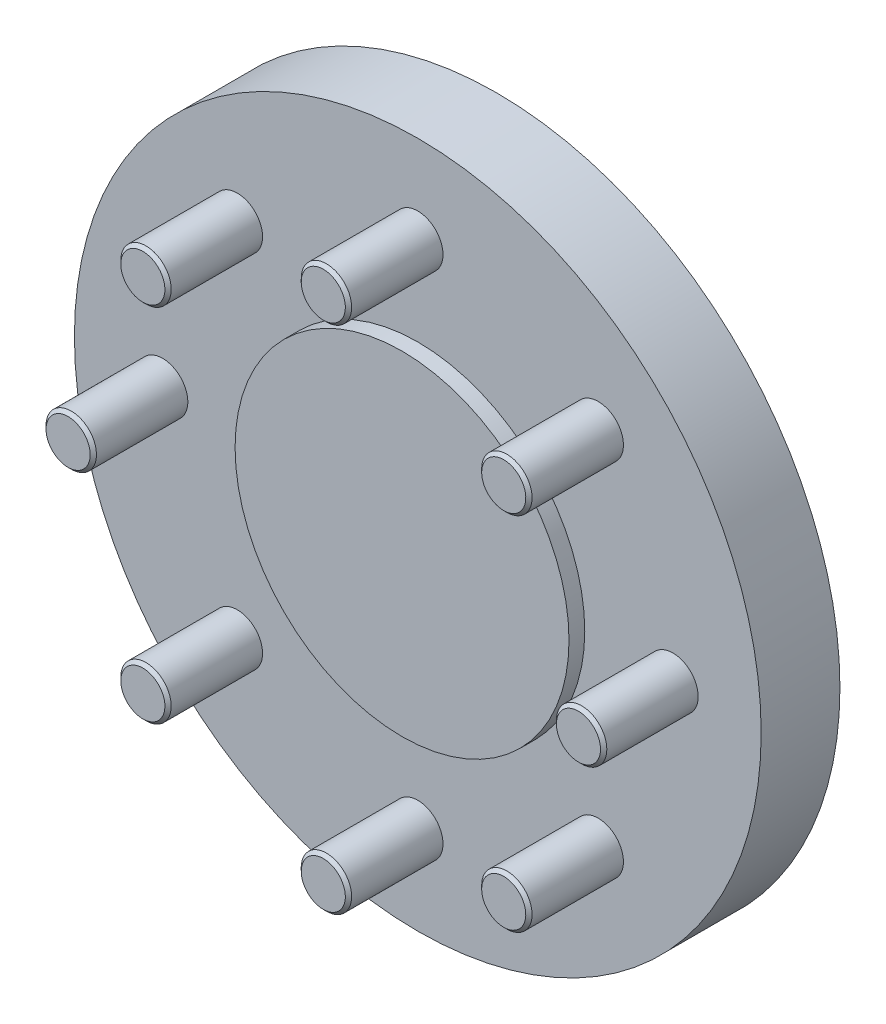
ISO-10303-21;
HEADER;
FILE_DESCRIPTION(('STEP AP214'),'2;1');
FILE_NAME('part.step','',(''),(''),'','','');
FILE_SCHEMA(('AUTOMOTIVE_DESIGN { 1 0 10303 214 1 1 1 1 }'));
ENDSEC;
DATA;
#1=APPLICATION_CONTEXT('core data for automotive mechanical design processes');
#2=APPLICATION_PROTOCOL_DEFINITION('international standard','automotive_design',2000,#1);
#3=PRODUCT_CONTEXT('',#1,'mechanical');
#4=PRODUCT('Part','Part','',(#3));
#5=PRODUCT_RELATED_PRODUCT_CATEGORY('part','',(#4));
#6=PRODUCT_DEFINITION_FORMATION('','',#4);
#7=PRODUCT_DEFINITION_CONTEXT('part definition',#1,'design');
#8=PRODUCT_DEFINITION('design','',#6,#7);
#9=PRODUCT_DEFINITION_SHAPE('','',#8);
#10=(LENGTH_UNIT() NAMED_UNIT(*) SI_UNIT(.MILLI.,.METRE.));
#11=(NAMED_UNIT(*) PLANE_ANGLE_UNIT() SI_UNIT($,.RADIAN.));
#12=(NAMED_UNIT(*) SI_UNIT($,.STERADIAN.) SOLID_ANGLE_UNIT());
#13=UNCERTAINTY_MEASURE_WITH_UNIT(LENGTH_MEASURE(1.E-05),#10,'distance_accuracy_value','');
#14=(GEOMETRIC_REPRESENTATION_CONTEXT(3) GLOBAL_UNCERTAINTY_ASSIGNED_CONTEXT((#13)) GLOBAL_UNIT_ASSIGNED_CONTEXT((#10,
#11,#12)) REPRESENTATION_CONTEXT('',''));
#15=CARTESIAN_POINT('',(0.,0.,0.));
#16=DIRECTION('',(0.,0.,1.));
#17=DIRECTION('',(1.,0.,0.));
#18=AXIS2_PLACEMENT_3D('',#15,#16,#17);
#19=CARTESIAN_POINT('',(53.,0.,0.));
#20=DIRECTION('',(0.,0.,1.));
#21=DIRECTION('',(1.,0.,0.));
#22=AXIS2_PLACEMENT_3D('',#19,#20,#21);
#23=PLANE('',#22);
#24=CARTESIAN_POINT('',(0.,0.,0.));
#25=DIRECTION('',(0.,0.,1.));
#26=DIRECTION('',(1.,0.,0.));
#27=AXIS2_PLACEMENT_3D('',#24,#25,#26);
#28=CIRCLE('',#27,53.);
#29=CARTESIAN_POINT('',(53.,0.,0.));
#30=VERTEX_POINT('',#29);
#31=EDGE_CURVE('E67',#30,#30,#28,.T.);
#32=ORIENTED_EDGE('',*,*,#31,.T.);
#33=EDGE_LOOP('',(#32));
#34=FACE_BOUND('',#33,.T.);
#35=ADVANCED_FACE('F37',(#34),#23,.T.);
#36=CARTESIAN_POINT('',(0.,0.,-75.));
#37=DIRECTION('',(0.,0.,-1.));
#38=DIRECTION('',(-1.,0.,0.));
#39=AXIS2_PLACEMENT_3D('',#36,#37,#38);
#40=PLANE('',#39);
#41=CARTESIAN_POINT('',(0.,0.,-75.));
#42=DIRECTION('',(0.,0.,1.));
#43=DIRECTION('',(1.,0.,0.));
#44=AXIS2_PLACEMENT_3D('',#41,#42,#43);
#45=CIRCLE('',#44,30.);
#46=CARTESIAN_POINT('',(30.,0.,-75.));
#47=VERTEX_POINT('',#46);
#48=EDGE_CURVE('E49',#47,#47,#45,.T.);
#49=ORIENTED_EDGE('',*,*,#48,.F.);
#50=EDGE_LOOP('',(#49));
#51=FACE_BOUND('',#50,.T.);
#52=ADVANCED_FACE('F170',(#51),#40,.T.);
#53=CARTESIAN_POINT('',(0.,0.,0.));
#54=DIRECTION('',(0.,0.,1.));
#55=DIRECTION('',(1.,0.,0.));
#56=AXIS2_PLACEMENT_3D('',#53,#54,#55);
#57=CYLINDRICAL_SURFACE('',#56,30.);
#58=ORIENTED_EDGE('',*,*,#48,.T.);
#59=EDGE_LOOP('',(#58));
#60=FACE_BOUND('',#59,.T.);
#61=CARTESIAN_POINT('',(0.,0.,-30.));
#62=DIRECTION('',(0.,0.,1.));
#63=DIRECTION('',(1.,0.,0.));
#64=AXIS2_PLACEMENT_3D('',#61,#62,#63);
#65=CIRCLE('',#64,30.);
#66=CARTESIAN_POINT('',(30.,0.,-30.));
#67=VERTEX_POINT('',#66);
#68=EDGE_CURVE('E53',#67,#67,#65,.T.);
#69=ORIENTED_EDGE('',*,*,#68,.F.);
#70=EDGE_LOOP('',(#69));
#71=FACE_BOUND('',#70,.T.);
#72=ADVANCED_FACE('F174',(#60,#71),#57,.T.);
#73=CARTESIAN_POINT('',(30.,0.,-30.));
#74=DIRECTION('',(0.,0.,-1.));
#75=DIRECTION('',(-1.,0.,0.));
#76=AXIS2_PLACEMENT_3D('',#73,#74,#75);
#77=PLANE('',#76);
#78=ORIENTED_EDGE('',*,*,#68,.T.);
#79=EDGE_LOOP('',(#78));
#80=FACE_BOUND('',#79,.T.);
#81=CARTESIAN_POINT('',(0.,0.,-30.));
#82=DIRECTION('',(0.,0.,1.));
#83=DIRECTION('',(1.,0.,0.));
#84=AXIS2_PLACEMENT_3D('',#81,#82,#83);
#85=CIRCLE('',#84,109.);
#86=CARTESIAN_POINT('',(109.,0.,-30.));
#87=VERTEX_POINT('',#86);
#88=EDGE_CURVE('E58',#87,#87,#85,.T.);
#89=ORIENTED_EDGE('',*,*,#88,.F.);
#90=EDGE_LOOP('',(#89));
#91=FACE_BOUND('',#90,.T.);
#92=ADVANCED_FACE('F180',(#80,#91),#77,.T.);
#93=CARTESIAN_POINT('',(0.,0.,0.));
#94=DIRECTION('',(0.,0.,1.));
#95=DIRECTION('',(1.,0.,0.));
#96=AXIS2_PLACEMENT_3D('',#93,#94,#95);
#97=CYLINDRICAL_SURFACE('',#96,109.);
#98=ORIENTED_EDGE('',*,*,#88,.T.);
#99=EDGE_LOOP('',(#98));
#100=FACE_BOUND('',#99,.T.);
#101=CARTESIAN_POINT('',(0.,0.,-4.99999999999999));
#102=DIRECTION('',(0.,0.,1.));
#103=DIRECTION('',(1.,0.,0.));
#104=AXIS2_PLACEMENT_3D('',#101,#102,#103);
#105=CIRCLE('',#104,109.);
#106=CARTESIAN_POINT('',(109.,0.,-4.99999999999999));
#107=VERTEX_POINT('',#106);
#108=EDGE_CURVE('E61',#107,#107,#105,.T.);
#109=ORIENTED_EDGE('',*,*,#108,.F.);
#110=EDGE_LOOP('',(#109));
#111=FACE_BOUND('',#110,.T.);
#112=ADVANCED_FACE('F143',(#100,#111),#97,.T.);
#113=CARTESIAN_POINT('',(109.,0.,-4.99999999999999));
#114=DIRECTION('',(0.,0.,1.));
#115=DIRECTION('',(1.,0.,0.));
#116=AXIS2_PLACEMENT_3D('',#113,#114,#115);
#117=PLANE('',#116);
#118=CARTESIAN_POINT('',(57.275649276111,57.2756492761097,-4.99999999999999));
#119=DIRECTION('',(0.,0.,1.));
#120=DIRECTION('',(0.707106781186556,0.707106781186539,0.));
#121=AXIS2_PLACEMENT_3D('',#118,#119,#120);
#122=CIRCLE('',#121,8.00000000000001);
#123=CARTESIAN_POINT('',(62.9325035256035,62.932503525602,-4.99999999999999));
#124=VERTEX_POINT('',#123);
#125=EDGE_CURVE('E133',#124,#124,#122,.T.);
#126=ORIENTED_EDGE('',*,*,#125,.F.);
#127=EDGE_LOOP('',(#126));
#128=FACE_BOUND('',#127,.T.);
#129=CARTESIAN_POINT('',(8.48429965338881E-13,81.,-4.99999999999999));
#130=DIRECTION('',(0.,0.,1.));
#131=DIRECTION('',(0.,1.,0.));
#132=AXIS2_PLACEMENT_3D('',#129,#130,#131);
#133=CIRCLE('',#132,8.00000000000001);
#134=CARTESIAN_POINT('',(9.32225517471117E-13,89.,-4.99999999999999));
#135=VERTEX_POINT('',#134);
#136=EDGE_CURVE('E124',#135,#135,#133,.T.);
#137=ORIENTED_EDGE('',*,*,#136,.F.);
#138=EDGE_LOOP('',(#137));
#139=FACE_BOUND('',#138,.T.);
#140=CARTESIAN_POINT('',(-57.2756492761098,57.2756492761108,-4.99999999999999));
#141=DIRECTION('',(0.,0.,1.));
#142=DIRECTION('',(-0.707106781186541,0.707106781186554,0.));
#143=AXIS2_PLACEMENT_3D('',#140,#141,#142);
#144=CIRCLE('',#143,8.00000000000001);
#145=CARTESIAN_POINT('',(-62.9325035256022,62.9325035256033,-4.99999999999999));
#146=VERTEX_POINT('',#145);
#147=EDGE_CURVE('E115',#146,#146,#144,.T.);
#148=ORIENTED_EDGE('',*,*,#147,.F.);
#149=EDGE_LOOP('',(#148));
#150=FACE_BOUND('',#149,.T.);
#151=CARTESIAN_POINT('',(-81.,0.,-4.99999999999999));
#152=DIRECTION('',(0.,0.,1.));
#153=DIRECTION('',(-1.,0.,0.));
#154=AXIS2_PLACEMENT_3D('',#151,#152,#153);
#155=CIRCLE('',#154,8.00000000000001);
#156=CARTESIAN_POINT('',(-89.,0.,-4.99999999999999));
#157=VERTEX_POINT('',#156);
#158=EDGE_CURVE('E106',#157,#157,#155,.T.);
#159=ORIENTED_EDGE('',*,*,#158,.F.);
#160=EDGE_LOOP('',(#159));
#161=FACE_BOUND('',#160,.T.);
#162=CARTESIAN_POINT('',(-57.2756492761107,-57.2756492761101,-4.99999999999999));
#163=DIRECTION('',(0.,0.,1.));
#164=DIRECTION('',(-0.707106781186551,-0.707106781186544,0.));
#165=AXIS2_PLACEMENT_3D('',#162,#163,#164);
#166=CIRCLE('',#165,8.00000000000001);
#167=CARTESIAN_POINT('',(-62.9325035256031,-62.9325035256024,-4.99999999999999));
#168=VERTEX_POINT('',#167);
#169=EDGE_CURVE('E97',#168,#168,#166,.T.);
#170=ORIENTED_EDGE('',*,*,#169,.F.);
#171=EDGE_LOOP('',(#170));
#172=FACE_BOUND('',#171,.T.);
#173=CARTESIAN_POINT('',(-2.82809988446294E-13,-81.,-4.99999999999999));
#174=DIRECTION('',(0.,0.,1.));
#175=DIRECTION('',(0.,-1.,0.));
#176=AXIS2_PLACEMENT_3D('',#173,#174,#175);
#177=CIRCLE('',#176,8.00000000000001);
#178=CARTESIAN_POINT('',(-3.10741839157039E-13,-89.,-4.99999999999999));
#179=VERTEX_POINT('',#178);
#180=EDGE_CURVE('E88',#179,#179,#177,.T.);
#181=ORIENTED_EDGE('',*,*,#180,.F.);
#182=EDGE_LOOP('',(#181));
#183=FACE_BOUND('',#182,.T.);
#184=CARTESIAN_POINT('',(57.2756492761103,-57.2756492761104,-4.99999999999999));
#185=DIRECTION('',(0.,0.,1.));
#186=DIRECTION('',(0.707106781186546,-0.707106781186549,0.));
#187=AXIS2_PLACEMENT_3D('',#184,#185,#186);
#188=CIRCLE('',#187,8.00000000000001);
#189=CARTESIAN_POINT('',(62.9325035256026,-62.9325035256029,-4.99999999999999));
#190=VERTEX_POINT('',#189);
#191=EDGE_CURVE('E79',#190,#190,#188,.T.);
#192=ORIENTED_EDGE('',*,*,#191,.F.);
#193=EDGE_LOOP('',(#192));
#194=FACE_BOUND('',#193,.T.);
#195=CARTESIAN_POINT('',(81.,0.,-4.99999999999999));
#196=DIRECTION('',(0.,0.,1.));
#197=DIRECTION('',(1.,0.,0.));
#198=AXIS2_PLACEMENT_3D('',#195,#196,#197);
#199=CIRCLE('',#198,8.00000000000001);
#200=CARTESIAN_POINT('',(89.,0.,-4.99999999999999));
#201=VERTEX_POINT('',#200);
#202=EDGE_CURVE('E70',#201,#201,#199,.T.);
#203=ORIENTED_EDGE('',*,*,#202,.F.);
#204=EDGE_LOOP('',(#203));
#205=FACE_BOUND('',#204,.T.);
#206=ORIENTED_EDGE('',*,*,#108,.T.);
#207=EDGE_LOOP('',(#206));
#208=FACE_BOUND('',#207,.T.);
#209=CARTESIAN_POINT('',(0.,0.,-4.99999999999999));
#210=DIRECTION('',(0.,0.,1.));
#211=DIRECTION('',(1.,0.,0.));
#212=AXIS2_PLACEMENT_3D('',#209,#210,#211);
#213=CIRCLE('',#212,53.);
#214=CARTESIAN_POINT('',(53.,0.,-4.99999999999999));
#215=VERTEX_POINT('',#214);
#216=EDGE_CURVE('E64',#215,#215,#213,.T.);
#217=ORIENTED_EDGE('',*,*,#216,.F.);
#218=EDGE_LOOP('',(#217));
#219=FACE_BOUND('',#218,.T.);
#220=ADVANCED_FACE('F139',(#128,#139,#150,#161,#172,#183,#194,#205,#208,#219),#117,.T.);
#221=CARTESIAN_POINT('',(0.,0.,0.));
#222=DIRECTION('',(0.,0.,1.));
#223=DIRECTION('',(1.,0.,0.));
#224=AXIS2_PLACEMENT_3D('',#221,#222,#223);
#225=CYLINDRICAL_SURFACE('',#224,53.);
#226=ORIENTED_EDGE('',*,*,#216,.T.);
#227=EDGE_LOOP('',(#226));
#228=FACE_BOUND('',#227,.T.);
#229=ORIENTED_EDGE('',*,*,#31,.F.);
#230=EDGE_LOOP('',(#229));
#231=FACE_BOUND('',#230,.T.);
#232=ADVANCED_FACE('F142',(#228,#231),#225,.T.);
#233=CARTESIAN_POINT('',(81.,0.,25.));
#234=DIRECTION('',(0.,0.,-1.));
#235=DIRECTION('',(-1.,0.,0.));
#236=AXIS2_PLACEMENT_3D('',#233,#234,#235);
#237=CYLINDRICAL_SURFACE('',#236,8.00000000000001);
#238=CARTESIAN_POINT('',(81.,0.,24.));
#239=DIRECTION('',(0.,0.,1.));
#240=DIRECTION('',(1.,0.,0.));
#241=AXIS2_PLACEMENT_3D('',#238,#239,#240);
#242=CIRCLE('',#241,8.00000000000001);
#243=CARTESIAN_POINT('',(89.,0.,24.));
#244=VERTEX_POINT('',#243);
#245=EDGE_CURVE('E10',#244,#244,#242,.F.);
#246=ORIENTED_EDGE('',*,*,#245,.T.);
#247=EDGE_LOOP('',(#246));
#248=FACE_BOUND('',#247,.T.);
#249=ORIENTED_EDGE('',*,*,#202,.T.);
#250=EDGE_LOOP('',(#249));
#251=FACE_BOUND('',#250,.T.);
#252=ADVANCED_FACE('F165',(#248,#251),#237,.T.);
#253=CARTESIAN_POINT('',(81.,0.,25.));
#254=DIRECTION('',(0.,0.,1.));
#255=DIRECTION('',(1.,0.,0.));
#256=AXIS2_PLACEMENT_3D('',#253,#254,#255);
#257=PLANE('',#256);
#258=CARTESIAN_POINT('',(81.,0.,25.));
#259=DIRECTION('',(0.,0.,1.));
#260=DIRECTION('',(1.,0.,0.));
#261=AXIS2_PLACEMENT_3D('',#258,#259,#260);
#262=CIRCLE('',#261,6.99999999999998);
#263=CARTESIAN_POINT('',(88.,0.,25.));
#264=VERTEX_POINT('',#263);
#265=EDGE_CURVE('E45',#264,#264,#262,.T.);
#266=ORIENTED_EDGE('',*,*,#265,.T.);
#267=EDGE_LOOP('',(#266));
#268=FACE_BOUND('',#267,.T.);
#269=ADVANCED_FACE('F190',(#268),#257,.T.);
#270=CARTESIAN_POINT('',(81.,0.,25.));
#271=DIRECTION('',(0.,0.,-1.));
#272=DIRECTION('',(-1.,0.,0.));
#273=AXIS2_PLACEMENT_3D('',#270,#271,#272);
#274=CONICAL_SURFACE('',#273,6.99999999999998,0.785398163397461);
#275=ORIENTED_EDGE('',*,*,#245,.F.);
#276=EDGE_LOOP('',(#275));
#277=FACE_BOUND('',#276,.T.);
#278=ORIENTED_EDGE('',*,*,#265,.F.);
#279=EDGE_LOOP('',(#278));
#280=FACE_BOUND('',#279,.T.);
#281=ADVANCED_FACE('F40',(#277,#280),#274,.T.);
#282=CARTESIAN_POINT('',(57.2756492761103,-57.2756492761104,25.));
#283=DIRECTION('',(0.,0.,-1.));
#284=DIRECTION('',(-0.707106781186546,0.707106781186549,0.));
#285=AXIS2_PLACEMENT_3D('',#282,#283,#284);
#286=CYLINDRICAL_SURFACE('',#285,8.00000000000001);
#287=CARTESIAN_POINT('',(57.2756492761103,-57.2756492761104,24.));
#288=DIRECTION('',(0.,0.,1.));
#289=DIRECTION('',(0.707106781186546,-0.707106781186549,0.));
#290=AXIS2_PLACEMENT_3D('',#287,#288,#289);
#291=CIRCLE('',#290,8.00000000000001);
#292=CARTESIAN_POINT('',(62.9325035256026,-62.9325035256029,24.));
#293=VERTEX_POINT('',#292);
#294=EDGE_CURVE('E76',#293,#293,#291,.F.);
#295=ORIENTED_EDGE('',*,*,#294,.T.);
#296=EDGE_LOOP('',(#295));
#297=FACE_BOUND('',#296,.T.);
#298=ORIENTED_EDGE('',*,*,#191,.T.);
#299=EDGE_LOOP('',(#298));
#300=FACE_BOUND('',#299,.T.);
#301=ADVANCED_FACE('F193',(#297,#300),#286,.T.);
#302=CARTESIAN_POINT('',(57.2756492761103,-57.2756492761104,25.));
#303=DIRECTION('',(0.,0.,1.));
#304=DIRECTION('',(0.707106781186546,-0.707106781186549,0.));
#305=AXIS2_PLACEMENT_3D('',#302,#303,#304);
#306=PLANE('',#305);
#307=CARTESIAN_POINT('',(57.2756492761103,-57.2756492761104,25.));
#308=DIRECTION('',(0.,0.,1.));
#309=DIRECTION('',(0.707106781186546,-0.707106781186549,0.));
#310=AXIS2_PLACEMENT_3D('',#307,#308,#309);
#311=CIRCLE('',#310,6.99999999999998);
#312=CARTESIAN_POINT('',(62.2253967444161,-62.2253967444163,25.));
#313=VERTEX_POINT('',#312);
#314=EDGE_CURVE('E73',#313,#313,#311,.T.);
#315=ORIENTED_EDGE('',*,*,#314,.T.);
#316=EDGE_LOOP('',(#315));
#317=FACE_BOUND('',#316,.T.);
#318=ADVANCED_FACE('F196',(#317),#306,.T.);
#319=CARTESIAN_POINT('',(57.2756492761103,-57.2756492761104,25.));
#320=DIRECTION('',(0.,0.,-1.));
#321=DIRECTION('',(-0.707106781186546,0.707106781186549,0.));
#322=AXIS2_PLACEMENT_3D('',#319,#320,#321);
#323=CONICAL_SURFACE('',#322,6.99999999999998,0.785398163397461);
#324=ORIENTED_EDGE('',*,*,#294,.F.);
#325=EDGE_LOOP('',(#324));
#326=FACE_BOUND('',#325,.T.);
#327=ORIENTED_EDGE('',*,*,#314,.F.);
#328=EDGE_LOOP('',(#327));
#329=FACE_BOUND('',#328,.T.);
#330=ADVANCED_FACE('F200',(#326,#329),#323,.T.);
#331=CARTESIAN_POINT('',(-2.82809988446294E-13,-81.,25.));
#332=DIRECTION('',(0.,0.,-1.));
#333=DIRECTION('',(0.,1.,0.));
#334=AXIS2_PLACEMENT_3D('',#331,#332,#333);
#335=CYLINDRICAL_SURFACE('',#334,8.00000000000001);
#336=CARTESIAN_POINT('',(-2.82809988446294E-13,-81.,24.));
#337=DIRECTION('',(0.,0.,1.));
#338=DIRECTION('',(0.,-1.,0.));
#339=AXIS2_PLACEMENT_3D('',#336,#337,#338);
#340=CIRCLE('',#339,8.00000000000001);
#341=CARTESIAN_POINT('',(-3.10741839157039E-13,-89.,24.));
#342=VERTEX_POINT('',#341);
#343=EDGE_CURVE('E85',#342,#342,#340,.F.);
#344=ORIENTED_EDGE('',*,*,#343,.T.);
#345=EDGE_LOOP('',(#344));
#346=FACE_BOUND('',#345,.T.);
#347=ORIENTED_EDGE('',*,*,#180,.T.);
#348=EDGE_LOOP('',(#347));
#349=FACE_BOUND('',#348,.T.);
#350=ADVANCED_FACE('F208',(#346,#349),#335,.T.);
#351=CARTESIAN_POINT('',(-2.82809988446294E-13,-81.,25.));
#352=DIRECTION('',(0.,0.,1.));
#353=DIRECTION('',(0.,-1.,0.));
#354=AXIS2_PLACEMENT_3D('',#351,#352,#353);
#355=PLANE('',#354);
#356=CARTESIAN_POINT('',(-2.82809988446294E-13,-81.,25.));
#357=DIRECTION('',(0.,0.,1.));
#358=DIRECTION('',(0.,-1.,0.));
#359=AXIS2_PLACEMENT_3D('',#356,#357,#358);
#360=CIRCLE('',#359,6.99999999999998);
#361=CARTESIAN_POINT('',(-3.07250357818196E-13,-88.,25.));
#362=VERTEX_POINT('',#361);
#363=EDGE_CURVE('E82',#362,#362,#360,.T.);
#364=ORIENTED_EDGE('',*,*,#363,.T.);
#365=EDGE_LOOP('',(#364));
#366=FACE_BOUND('',#365,.T.);
#367=ADVANCED_FACE('F212',(#366),#355,.T.);
#368=CARTESIAN_POINT('',(-2.82809988446294E-13,-81.,25.));
#369=DIRECTION('',(0.,0.,-1.));
#370=DIRECTION('',(0.,1.,0.));
#371=AXIS2_PLACEMENT_3D('',#368,#369,#370);
#372=CONICAL_SURFACE('',#371,6.99999999999998,0.785398163397461);
#373=ORIENTED_EDGE('',*,*,#343,.F.);
#374=EDGE_LOOP('',(#373));
#375=FACE_BOUND('',#374,.T.);
#376=ORIENTED_EDGE('',*,*,#363,.F.);
#377=EDGE_LOOP('',(#376));
#378=FACE_BOUND('',#377,.T.);
#379=ADVANCED_FACE('F216',(#375,#378),#372,.T.);
#380=CARTESIAN_POINT('',(-57.2756492761107,-57.2756492761101,25.));
#381=DIRECTION('',(0.,0.,-1.));
#382=DIRECTION('',(0.707106781186551,0.707106781186544,0.));
#383=AXIS2_PLACEMENT_3D('',#380,#381,#382);
#384=CYLINDRICAL_SURFACE('',#383,8.00000000000001);
#385=CARTESIAN_POINT('',(-57.2756492761107,-57.2756492761101,24.));
#386=DIRECTION('',(0.,0.,1.));
#387=DIRECTION('',(-0.707106781186551,-0.707106781186544,0.));
#388=AXIS2_PLACEMENT_3D('',#385,#386,#387);
#389=CIRCLE('',#388,8.00000000000001);
#390=CARTESIAN_POINT('',(-62.9325035256031,-62.9325035256024,24.));
#391=VERTEX_POINT('',#390);
#392=EDGE_CURVE('E94',#391,#391,#389,.F.);
#393=ORIENTED_EDGE('',*,*,#392,.T.);
#394=EDGE_LOOP('',(#393));
#395=FACE_BOUND('',#394,.T.);
#396=ORIENTED_EDGE('',*,*,#169,.T.);
#397=EDGE_LOOP('',(#396));
#398=FACE_BOUND('',#397,.T.);
#399=ADVANCED_FACE('F223',(#395,#398),#384,.T.);
#400=CARTESIAN_POINT('',(-57.2756492761107,-57.2756492761101,25.));
#401=DIRECTION('',(0.,0.,1.));
#402=DIRECTION('',(-0.707106781186551,-0.707106781186544,0.));
#403=AXIS2_PLACEMENT_3D('',#400,#401,#402);
#404=PLANE('',#403);
#405=CARTESIAN_POINT('',(-57.2756492761107,-57.2756492761101,25.));
#406=DIRECTION('',(0.,0.,1.));
#407=DIRECTION('',(-0.707106781186551,-0.707106781186544,0.));
#408=AXIS2_PLACEMENT_3D('',#405,#406,#407);
#409=CIRCLE('',#408,6.99999999999998);
#410=CARTESIAN_POINT('',(-62.2253967444165,-62.2253967444158,25.));
#411=VERTEX_POINT('',#410);
#412=EDGE_CURVE('E91',#411,#411,#409,.T.);
#413=ORIENTED_EDGE('',*,*,#412,.T.);
#414=EDGE_LOOP('',(#413));
#415=FACE_BOUND('',#414,.T.);
#416=ADVANCED_FACE('F227',(#415),#404,.T.);
#417=CARTESIAN_POINT('',(-57.2756492761107,-57.2756492761101,25.));
#418=DIRECTION('',(0.,0.,-1.));
#419=DIRECTION('',(0.707106781186551,0.707106781186544,0.));
#420=AXIS2_PLACEMENT_3D('',#417,#418,#419);
#421=CONICAL_SURFACE('',#420,6.99999999999998,0.785398163397461);
#422=ORIENTED_EDGE('',*,*,#392,.F.);
#423=EDGE_LOOP('',(#422));
#424=FACE_BOUND('',#423,.T.);
#425=ORIENTED_EDGE('',*,*,#412,.F.);
#426=EDGE_LOOP('',(#425));
#427=FACE_BOUND('',#426,.T.);
#428=ADVANCED_FACE('F231',(#424,#427),#421,.T.);
#429=CARTESIAN_POINT('',(-81.,0.,25.));
#430=DIRECTION('',(0.,0.,-1.));
#431=DIRECTION('',(1.,0.,0.));
#432=AXIS2_PLACEMENT_3D('',#429,#430,#431);
#433=CYLINDRICAL_SURFACE('',#432,8.00000000000001);
#434=CARTESIAN_POINT('',(-81.,0.,24.));
#435=DIRECTION('',(0.,0.,1.));
#436=DIRECTION('',(-1.,0.,0.));
#437=AXIS2_PLACEMENT_3D('',#434,#435,#436);
#438=CIRCLE('',#437,8.00000000000001);
#439=CARTESIAN_POINT('',(-89.,0.,24.));
#440=VERTEX_POINT('',#439);
#441=EDGE_CURVE('E103',#440,#440,#438,.F.);
#442=ORIENTED_EDGE('',*,*,#441,.T.);
#443=EDGE_LOOP('',(#442));
#444=FACE_BOUND('',#443,.T.);
#445=ORIENTED_EDGE('',*,*,#158,.T.);
#446=EDGE_LOOP('',(#445));
#447=FACE_BOUND('',#446,.T.);
#448=ADVANCED_FACE('F238',(#444,#447),#433,.T.);
#449=CARTESIAN_POINT('',(-81.,0.,25.));
#450=DIRECTION('',(0.,0.,1.));
#451=DIRECTION('',(-1.,0.,0.));
#452=AXIS2_PLACEMENT_3D('',#449,#450,#451);
#453=PLANE('',#452);
#454=CARTESIAN_POINT('',(-81.,0.,25.));
#455=DIRECTION('',(0.,0.,1.));
#456=DIRECTION('',(-1.,0.,0.));
#457=AXIS2_PLACEMENT_3D('',#454,#455,#456);
#458=CIRCLE('',#457,6.99999999999998);
#459=CARTESIAN_POINT('',(-88.,0.,25.));
#460=VERTEX_POINT('',#459);
#461=EDGE_CURVE('E100',#460,#460,#458,.T.);
#462=ORIENTED_EDGE('',*,*,#461,.T.);
#463=EDGE_LOOP('',(#462));
#464=FACE_BOUND('',#463,.T.);
#465=ADVANCED_FACE('F242',(#464),#453,.T.);
#466=CARTESIAN_POINT('',(-81.,0.,25.));
#467=DIRECTION('',(0.,0.,-1.));
#468=DIRECTION('',(1.,0.,0.));
#469=AXIS2_PLACEMENT_3D('',#466,#467,#468);
#470=CONICAL_SURFACE('',#469,6.99999999999998,0.785398163397461);
#471=ORIENTED_EDGE('',*,*,#441,.F.);
#472=EDGE_LOOP('',(#471));
#473=FACE_BOUND('',#472,.T.);
#474=ORIENTED_EDGE('',*,*,#461,.F.);
#475=EDGE_LOOP('',(#474));
#476=FACE_BOUND('',#475,.T.);
#477=ADVANCED_FACE('F246',(#473,#476),#470,.T.);
#478=CARTESIAN_POINT('',(-57.2756492761098,57.2756492761108,25.));
#479=DIRECTION('',(0.,0.,-1.));
#480=DIRECTION('',(0.707106781186541,-0.707106781186554,0.));
#481=AXIS2_PLACEMENT_3D('',#478,#479,#480);
#482=CYLINDRICAL_SURFACE('',#481,8.00000000000001);
#483=CARTESIAN_POINT('',(-57.2756492761098,57.2756492761108,24.));
#484=DIRECTION('',(0.,0.,1.));
#485=DIRECTION('',(-0.707106781186541,0.707106781186554,0.));
#486=AXIS2_PLACEMENT_3D('',#483,#484,#485);
#487=CIRCLE('',#486,8.00000000000001);
#488=CARTESIAN_POINT('',(-62.9325035256022,62.9325035256033,24.));
#489=VERTEX_POINT('',#488);
#490=EDGE_CURVE('E112',#489,#489,#487,.F.);
#491=ORIENTED_EDGE('',*,*,#490,.T.);
#492=EDGE_LOOP('',(#491));
#493=FACE_BOUND('',#492,.T.);
#494=ORIENTED_EDGE('',*,*,#147,.T.);
#495=EDGE_LOOP('',(#494));
#496=FACE_BOUND('',#495,.T.);
#497=ADVANCED_FACE('F253',(#493,#496),#482,.T.);
#498=CARTESIAN_POINT('',(-57.2756492761098,57.2756492761108,25.));
#499=DIRECTION('',(0.,0.,1.));
#500=DIRECTION('',(-0.707106781186541,0.707106781186554,0.));
#501=AXIS2_PLACEMENT_3D('',#498,#499,#500);
#502=PLANE('',#501);
#503=CARTESIAN_POINT('',(-57.2756492761098,57.2756492761108,25.));
#504=DIRECTION('',(0.,0.,1.));
#505=DIRECTION('',(-0.707106781186541,0.707106781186554,0.));
#506=AXIS2_PLACEMENT_3D('',#503,#504,#505);
#507=CIRCLE('',#506,6.99999999999998);
#508=CARTESIAN_POINT('',(-62.2253967444156,62.2253967444167,25.));
#509=VERTEX_POINT('',#508);
#510=EDGE_CURVE('E109',#509,#509,#507,.T.);
#511=ORIENTED_EDGE('',*,*,#510,.T.);
#512=EDGE_LOOP('',(#511));
#513=FACE_BOUND('',#512,.T.);
#514=ADVANCED_FACE('F257',(#513),#502,.T.);
#515=CARTESIAN_POINT('',(-57.2756492761098,57.2756492761108,25.));
#516=DIRECTION('',(0.,0.,-1.));
#517=DIRECTION('',(0.707106781186541,-0.707106781186554,0.));
#518=AXIS2_PLACEMENT_3D('',#515,#516,#517);
#519=CONICAL_SURFACE('',#518,6.99999999999998,0.785398163397461);
#520=ORIENTED_EDGE('',*,*,#490,.F.);
#521=EDGE_LOOP('',(#520));
#522=FACE_BOUND('',#521,.T.);
#523=ORIENTED_EDGE('',*,*,#510,.F.);
#524=EDGE_LOOP('',(#523));
#525=FACE_BOUND('',#524,.T.);
#526=ADVANCED_FACE('F261',(#522,#525),#519,.T.);
#527=CARTESIAN_POINT('',(8.48429965338881E-13,81.,25.));
#528=DIRECTION('',(0.,0.,-1.));
#529=DIRECTION('',(0.,-1.,0.));
#530=AXIS2_PLACEMENT_3D('',#527,#528,#529);
#531=CYLINDRICAL_SURFACE('',#530,8.00000000000001);
#532=CARTESIAN_POINT('',(8.48429965338881E-13,81.,24.));
#533=DIRECTION('',(0.,0.,1.));
#534=DIRECTION('',(0.,1.,0.));
#535=AXIS2_PLACEMENT_3D('',#532,#533,#534);
#536=CIRCLE('',#535,8.00000000000001);
#537=CARTESIAN_POINT('',(9.32225517471117E-13,89.,24.));
#538=VERTEX_POINT('',#537);
#539=EDGE_CURVE('E121',#538,#538,#536,.F.);
#540=ORIENTED_EDGE('',*,*,#539,.T.);
#541=EDGE_LOOP('',(#540));
#542=FACE_BOUND('',#541,.T.);
#543=ORIENTED_EDGE('',*,*,#136,.T.);
#544=EDGE_LOOP('',(#543));
#545=FACE_BOUND('',#544,.T.);
#546=ADVANCED_FACE('F268',(#542,#545),#531,.T.);
#547=CARTESIAN_POINT('',(8.48429965338881E-13,81.,25.));
#548=DIRECTION('',(0.,0.,1.));
#549=DIRECTION('',(0.,1.,0.));
#550=AXIS2_PLACEMENT_3D('',#547,#548,#549);
#551=PLANE('',#550);
#552=CARTESIAN_POINT('',(8.48429965338881E-13,81.,25.));
#553=DIRECTION('',(0.,0.,1.));
#554=DIRECTION('',(0.,1.,0.));
#555=AXIS2_PLACEMENT_3D('',#552,#553,#554);
#556=CIRCLE('',#555,6.99999999999998);
#557=CARTESIAN_POINT('',(9.21751073454587E-13,88.,25.));
#558=VERTEX_POINT('',#557);
#559=EDGE_CURVE('E118',#558,#558,#556,.T.);
#560=ORIENTED_EDGE('',*,*,#559,.T.);
#561=EDGE_LOOP('',(#560));
#562=FACE_BOUND('',#561,.T.);
#563=ADVANCED_FACE('F272',(#562),#551,.T.);
#564=CARTESIAN_POINT('',(8.48429965338881E-13,81.,25.));
#565=DIRECTION('',(0.,0.,-1.));
#566=DIRECTION('',(0.,-1.,0.));
#567=AXIS2_PLACEMENT_3D('',#564,#565,#566);
#568=CONICAL_SURFACE('',#567,6.99999999999998,0.785398163397461);
#569=ORIENTED_EDGE('',*,*,#539,.F.);
#570=EDGE_LOOP('',(#569));
#571=FACE_BOUND('',#570,.T.);
#572=ORIENTED_EDGE('',*,*,#559,.F.);
#573=EDGE_LOOP('',(#572));
#574=FACE_BOUND('',#573,.T.);
#575=ADVANCED_FACE('F276',(#571,#574),#568,.T.);
#576=CARTESIAN_POINT('',(57.275649276111,57.2756492761097,25.));
#577=DIRECTION('',(0.,0.,-1.));
#578=DIRECTION('',(-0.707106781186556,-0.707106781186539,0.));
#579=AXIS2_PLACEMENT_3D('',#576,#577,#578);
#580=CYLINDRICAL_SURFACE('',#579,8.00000000000001);
#581=CARTESIAN_POINT('',(57.275649276111,57.2756492761097,24.));
#582=DIRECTION('',(0.,0.,1.));
#583=DIRECTION('',(0.707106781186556,0.707106781186539,0.));
#584=AXIS2_PLACEMENT_3D('',#581,#582,#583);
#585=CIRCLE('',#584,8.00000000000001);
#586=CARTESIAN_POINT('',(62.9325035256035,62.932503525602,24.));
#587=VERTEX_POINT('',#586);
#588=EDGE_CURVE('E130',#587,#587,#585,.F.);
#589=ORIENTED_EDGE('',*,*,#588,.T.);
#590=EDGE_LOOP('',(#589));
#591=FACE_BOUND('',#590,.T.);
#592=ORIENTED_EDGE('',*,*,#125,.T.);
#593=EDGE_LOOP('',(#592));
#594=FACE_BOUND('',#593,.T.);
#595=ADVANCED_FACE('F137',(#591,#594),#580,.T.);
#596=CARTESIAN_POINT('',(57.275649276111,57.2756492761097,25.));
#597=DIRECTION('',(0.,0.,1.));
#598=DIRECTION('',(0.707106781186556,0.707106781186539,0.));
#599=AXIS2_PLACEMENT_3D('',#596,#597,#598);
#600=PLANE('',#599);
#601=CARTESIAN_POINT('',(57.275649276111,57.2756492761097,25.));
#602=DIRECTION('',(0.,0.,1.));
#603=DIRECTION('',(0.707106781186556,0.707106781186539,0.));
#604=AXIS2_PLACEMENT_3D('',#601,#602,#603);
#605=CIRCLE('',#604,6.99999999999998);
#606=CARTESIAN_POINT('',(62.2253967444169,62.2253967444154,25.));
#607=VERTEX_POINT('',#606);
#608=EDGE_CURVE('E127',#607,#607,#605,.T.);
#609=ORIENTED_EDGE('',*,*,#608,.T.);
#610=EDGE_LOOP('',(#609));
#611=FACE_BOUND('',#610,.T.);
#612=ADVANCED_FACE('F286',(#611),#600,.T.);
#613=CARTESIAN_POINT('',(57.275649276111,57.2756492761097,25.));
#614=DIRECTION('',(0.,0.,-1.));
#615=DIRECTION('',(-0.707106781186556,-0.707106781186539,0.));
#616=AXIS2_PLACEMENT_3D('',#613,#614,#615);
#617=CONICAL_SURFACE('',#616,6.99999999999998,0.785398163397461);
#618=ORIENTED_EDGE('',*,*,#588,.F.);
#619=EDGE_LOOP('',(#618));
#620=FACE_BOUND('',#619,.T.);
#621=ORIENTED_EDGE('',*,*,#608,.F.);
#622=EDGE_LOOP('',(#621));
#623=FACE_BOUND('',#622,.T.);
#624=ADVANCED_FACE('F290',(#620,#623),#617,.T.);
#625=CLOSED_SHELL('',(#35,#52,#72,#92,#112,#220,#232,#252,#269,#281,#301,#318,#330,#350,#367,
#379,#399,#416,#428,#448,#465,#477,#497,#514,#526,#546,#563,#575,#595,#612,#624));
#626=MANIFOLD_SOLID_BREP('B2',#625);
#627=ADVANCED_BREP_SHAPE_REPRESENTATION('',(#18,#626),#14);
#628=SHAPE_DEFINITION_REPRESENTATION(#9,#627);
ENDSEC;
END-ISO-10303-21;
